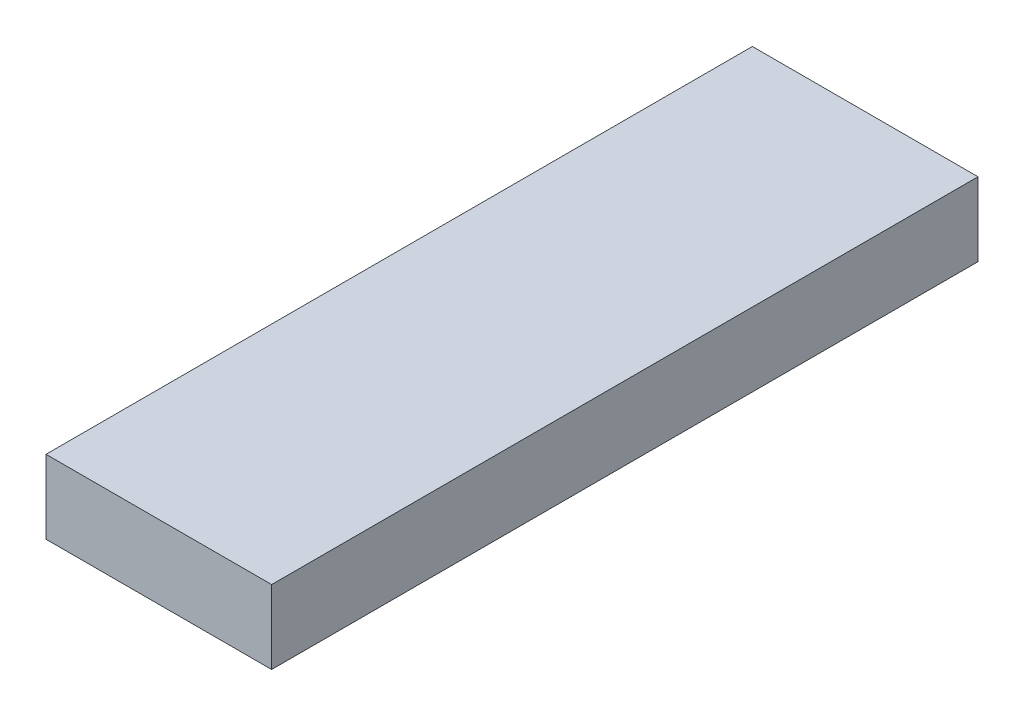
ISO-10303-21;
HEADER;
FILE_DESCRIPTION(('STEP AP214'),'2;1');
FILE_NAME('part.step','',(''),(''),'','','');
FILE_SCHEMA(('AUTOMOTIVE_DESIGN { 1 0 10303 214 1 1 1 1 }'));
ENDSEC;
DATA;
#1=APPLICATION_CONTEXT('core data for automotive mechanical design processes');
#2=APPLICATION_PROTOCOL_DEFINITION('international standard','automotive_design',2000,#1);
#3=PRODUCT_CONTEXT('',#1,'mechanical');
#4=PRODUCT('Part','Part','',(#3));
#5=PRODUCT_RELATED_PRODUCT_CATEGORY('part','',(#4));
#6=PRODUCT_DEFINITION_FORMATION('','',#4);
#7=PRODUCT_DEFINITION_CONTEXT('part definition',#1,'design');
#8=PRODUCT_DEFINITION('design','',#6,#7);
#9=PRODUCT_DEFINITION_SHAPE('','',#8);
#10=(LENGTH_UNIT() NAMED_UNIT(*) SI_UNIT(.MILLI.,.METRE.));
#11=(NAMED_UNIT(*) PLANE_ANGLE_UNIT() SI_UNIT($,.RADIAN.));
#12=(NAMED_UNIT(*) SI_UNIT($,.STERADIAN.) SOLID_ANGLE_UNIT());
#13=UNCERTAINTY_MEASURE_WITH_UNIT(LENGTH_MEASURE(1.E-05),#10,'distance_accuracy_value','');
#14=(GEOMETRIC_REPRESENTATION_CONTEXT(3) GLOBAL_UNCERTAINTY_ASSIGNED_CONTEXT((#13)) GLOBAL_UNIT_ASSIGNED_CONTEXT((#10,
#11,#12)) REPRESENTATION_CONTEXT('',''));
#15=CARTESIAN_POINT('',(0.,0.,0.));
#16=DIRECTION('',(0.,0.,1.));
#17=DIRECTION('',(1.,0.,0.));
#18=AXIS2_PLACEMENT_3D('',#15,#16,#17);
#19=CARTESIAN_POINT('',(-23.,15.,72.));
#20=DIRECTION('',(-1.,0.,0.));
#21=DIRECTION('',(0.,0.,1.));
#22=AXIS2_PLACEMENT_3D('',#19,#20,#21);
#23=PLANE('',#22);
#24=DIRECTION('',(0.,0.,-1.));
#25=VECTOR('',#24,1.);
#26=CARTESIAN_POINT('',(-23.,0.,72.));
#27=LINE('',#26,#25);
#28=CARTESIAN_POINT('',(-23.,0.,72.));
#29=VERTEX_POINT('',#28);
#30=CARTESIAN_POINT('',(-23.,0.,-72.));
#31=VERTEX_POINT('',#30);
#32=EDGE_CURVE('E97',#29,#31,#27,.T.);
#33=ORIENTED_EDGE('',*,*,#32,.F.);
#34=DIRECTION('',(0.,-1.,0.));
#35=VECTOR('',#34,1.);
#36=CARTESIAN_POINT('',(-23.,15.,72.));
#37=LINE('',#36,#35);
#38=CARTESIAN_POINT('',(-23.,15.,72.));
#39=VERTEX_POINT('',#38);
#40=EDGE_CURVE('E11',#39,#29,#37,.T.);
#41=ORIENTED_EDGE('',*,*,#40,.F.);
#42=DIRECTION('',(0.,0.,-1.));
#43=VECTOR('',#42,1.);
#44=CARTESIAN_POINT('',(-23.,15.,72.));
#45=LINE('',#44,#43);
#46=CARTESIAN_POINT('',(-23.,15.,-72.));
#47=VERTEX_POINT('',#46);
#48=EDGE_CURVE('E91',#39,#47,#45,.T.);
#49=ORIENTED_EDGE('',*,*,#48,.T.);
#50=DIRECTION('',(0.,-1.,0.));
#51=VECTOR('',#50,1.);
#52=CARTESIAN_POINT('',(-23.,15.,-72.));
#53=LINE('',#52,#51);
#54=EDGE_CURVE('E36',#47,#31,#53,.T.);
#55=ORIENTED_EDGE('',*,*,#54,.T.);
#56=EDGE_LOOP('',(#33,#41,#49,#55));
#57=FACE_BOUND('',#56,.T.);
#58=ADVANCED_FACE('F33',(#57),#23,.T.);
#59=CARTESIAN_POINT('',(23.,15.,72.));
#60=DIRECTION('',(0.,0.,1.));
#61=DIRECTION('',(1.,0.,0.));
#62=AXIS2_PLACEMENT_3D('',#59,#60,#61);
#63=PLANE('',#62);
#64=DIRECTION('',(-1.,0.,0.));
#65=VECTOR('',#64,1.);
#66=CARTESIAN_POINT('',(23.,0.,72.));
#67=LINE('',#66,#65);
#68=CARTESIAN_POINT('',(23.,0.,72.));
#69=VERTEX_POINT('',#68);
#70=EDGE_CURVE('E93',#69,#29,#67,.T.);
#71=ORIENTED_EDGE('',*,*,#70,.F.);
#72=DIRECTION('',(0.,-1.,0.));
#73=VECTOR('',#72,1.);
#74=CARTESIAN_POINT('',(23.,15.,72.));
#75=LINE('',#74,#73);
#76=CARTESIAN_POINT('',(23.,15.,72.));
#77=VERTEX_POINT('',#76);
#78=EDGE_CURVE('E42',#77,#69,#75,.T.);
#79=ORIENTED_EDGE('',*,*,#78,.F.);
#80=DIRECTION('',(-1.,0.,0.));
#81=VECTOR('',#80,1.);
#82=CARTESIAN_POINT('',(23.,15.,72.));
#83=LINE('',#82,#81);
#84=EDGE_CURVE('E84',#77,#39,#83,.T.);
#85=ORIENTED_EDGE('',*,*,#84,.T.);
#86=ORIENTED_EDGE('',*,*,#40,.T.);
#87=EDGE_LOOP('',(#71,#79,#85,#86));
#88=FACE_BOUND('',#87,.T.);
#89=ADVANCED_FACE('F107',(#88),#63,.T.);
#90=CARTESIAN_POINT('',(23.,15.,72.));
#91=DIRECTION('',(-1.,0.,0.));
#92=DIRECTION('',(0.,0.,1.));
#93=AXIS2_PLACEMENT_3D('',#90,#91,#92);
#94=PLANE('',#93);
#95=DIRECTION('',(0.,0.,-1.));
#96=VECTOR('',#95,1.);
#97=CARTESIAN_POINT('',(23.,0.,72.));
#98=LINE('',#97,#96);
#99=CARTESIAN_POINT('',(23.,0.,-72.));
#100=VERTEX_POINT('',#99);
#101=EDGE_CURVE('E88',#69,#100,#98,.T.);
#102=ORIENTED_EDGE('',*,*,#101,.T.);
#103=DIRECTION('',(0.,-1.,0.));
#104=VECTOR('',#103,1.);
#105=CARTESIAN_POINT('',(23.,15.,-72.));
#106=LINE('',#105,#104);
#107=CARTESIAN_POINT('',(23.,15.,-72.));
#108=VERTEX_POINT('',#107);
#109=EDGE_CURVE('E86',#108,#100,#106,.T.);
#110=ORIENTED_EDGE('',*,*,#109,.F.);
#111=DIRECTION('',(0.,0.,-1.));
#112=VECTOR('',#111,1.);
#113=CARTESIAN_POINT('',(23.,15.,72.));
#114=LINE('',#113,#112);
#115=EDGE_CURVE('E80',#77,#108,#114,.T.);
#116=ORIENTED_EDGE('',*,*,#115,.F.);
#117=ORIENTED_EDGE('',*,*,#78,.T.);
#118=EDGE_LOOP('',(#102,#110,#116,#117));
#119=FACE_BOUND('',#118,.T.);
#120=ADVANCED_FACE('F87',(#119),#94,.F.);
#121=CARTESIAN_POINT('',(-23.,15.,-72.));
#122=DIRECTION('',(0.,0.,-1.));
#123=DIRECTION('',(-1.,0.,0.));
#124=AXIS2_PLACEMENT_3D('',#121,#122,#123);
#125=PLANE('',#124);
#126=DIRECTION('',(1.,0.,0.));
#127=VECTOR('',#126,1.);
#128=CARTESIAN_POINT('',(-23.,0.,-72.));
#129=LINE('',#128,#127);
#130=EDGE_CURVE('E100',#31,#100,#129,.T.);
#131=ORIENTED_EDGE('',*,*,#130,.F.);
#132=ORIENTED_EDGE('',*,*,#54,.F.);
#133=DIRECTION('',(1.,0.,0.));
#134=VECTOR('',#133,1.);
#135=CARTESIAN_POINT('',(-23.,15.,-72.));
#136=LINE('',#135,#134);
#137=EDGE_CURVE('E83',#47,#108,#136,.T.);
#138=ORIENTED_EDGE('',*,*,#137,.T.);
#139=ORIENTED_EDGE('',*,*,#109,.T.);
#140=EDGE_LOOP('',(#131,#132,#138,#139));
#141=FACE_BOUND('',#140,.T.);
#142=ADVANCED_FACE('F90',(#141),#125,.T.);
#143=CARTESIAN_POINT('',(0.,15.,0.));
#144=DIRECTION('',(0.,-1.,0.));
#145=DIRECTION('',(0.,0.,-1.));
#146=AXIS2_PLACEMENT_3D('',#143,#144,#145);
#147=PLANE('',#146);
#148=ORIENTED_EDGE('',*,*,#48,.F.);
#149=ORIENTED_EDGE('',*,*,#84,.F.);
#150=ORIENTED_EDGE('',*,*,#115,.T.);
#151=ORIENTED_EDGE('',*,*,#137,.F.);
#152=EDGE_LOOP('',(#148,#149,#150,#151));
#153=FACE_BOUND('',#152,.T.);
#154=ADVANCED_FACE('F82',(#153),#147,.F.);
#155=CARTESIAN_POINT('',(0.,0.,0.));
#156=DIRECTION('',(0.,-1.,0.));
#157=DIRECTION('',(0.,0.,-1.));
#158=AXIS2_PLACEMENT_3D('',#155,#156,#157);
#159=PLANE('',#158);
#160=ORIENTED_EDGE('',*,*,#32,.T.);
#161=ORIENTED_EDGE('',*,*,#130,.T.);
#162=ORIENTED_EDGE('',*,*,#101,.F.);
#163=ORIENTED_EDGE('',*,*,#70,.T.);
#164=EDGE_LOOP('',(#160,#161,#162,#163));
#165=FACE_BOUND('',#164,.T.);
#166=ADVANCED_FACE('F106',(#165),#159,.T.);
#167=CLOSED_SHELL('',(#58,#89,#120,#142,#154,#166));
#168=MANIFOLD_SOLID_BREP('B2',#167);
#169=ADVANCED_BREP_SHAPE_REPRESENTATION('',(#18,#168),#14);
#170=SHAPE_DEFINITION_REPRESENTATION(#9,#169);
ENDSEC;
END-ISO-10303-21;
